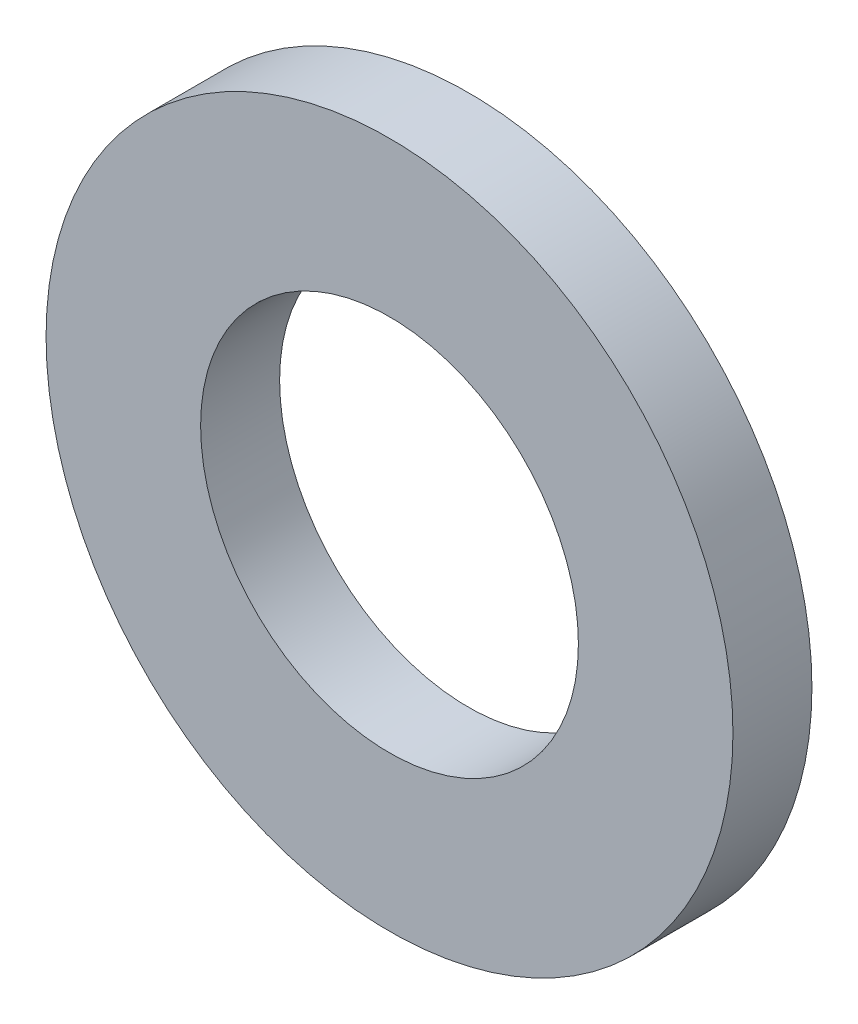
ISO-10303-21;
HEADER;
FILE_DESCRIPTION(('STEP AP214'),'2;1');
FILE_NAME('part.step','',(''),(''),'','','');
FILE_SCHEMA(('AUTOMOTIVE_DESIGN { 1 0 10303 214 1 1 1 1 }'));
ENDSEC;
DATA;
#1=APPLICATION_CONTEXT('core data for automotive mechanical design processes');
#2=APPLICATION_PROTOCOL_DEFINITION('international standard','automotive_design',2000,#1);
#3=PRODUCT_CONTEXT('',#1,'mechanical');
#4=PRODUCT('Part','Part','',(#3));
#5=PRODUCT_RELATED_PRODUCT_CATEGORY('part','',(#4));
#6=PRODUCT_DEFINITION_FORMATION('','',#4);
#7=PRODUCT_DEFINITION_CONTEXT('part definition',#1,'design');
#8=PRODUCT_DEFINITION('design','',#6,#7);
#9=PRODUCT_DEFINITION_SHAPE('','',#8);
#10=(LENGTH_UNIT() NAMED_UNIT(*) SI_UNIT(.MILLI.,.METRE.));
#11=(NAMED_UNIT(*) PLANE_ANGLE_UNIT() SI_UNIT($,.RADIAN.));
#12=(NAMED_UNIT(*) SI_UNIT($,.STERADIAN.) SOLID_ANGLE_UNIT());
#13=UNCERTAINTY_MEASURE_WITH_UNIT(LENGTH_MEASURE(1.E-05),#10,'distance_accuracy_value','');
#14=(GEOMETRIC_REPRESENTATION_CONTEXT(3) GLOBAL_UNCERTAINTY_ASSIGNED_CONTEXT((#13)) GLOBAL_UNIT_ASSIGNED_CONTEXT((#10,
#11,#12)) REPRESENTATION_CONTEXT('',''));
#15=CARTESIAN_POINT('',(0.,0.,0.));
#16=DIRECTION('',(0.,0.,1.));
#17=DIRECTION('',(1.,0.,0.));
#18=AXIS2_PLACEMENT_3D('',#15,#16,#17);
#19=CARTESIAN_POINT('',(0.,0.,2.3));
#20=DIRECTION('',(0.,0.,1.));
#21=DIRECTION('',(1.,0.,0.));
#22=AXIS2_PLACEMENT_3D('',#19,#20,#21);
#23=PLANE('',#22);
#24=CARTESIAN_POINT('',(0.,0.,2.3));
#25=DIRECTION('',(0.,0.,1.));
#26=DIRECTION('',(1.,0.,0.));
#27=AXIS2_PLACEMENT_3D('',#24,#25,#26);
#28=CIRCLE('',#27,10.);
#29=CARTESIAN_POINT('',(10.,0.,2.3));
#30=VERTEX_POINT('',#29);
#31=EDGE_CURVE('E10',#30,#30,#28,.T.);
#32=ORIENTED_EDGE('',*,*,#31,.T.);
#33=EDGE_LOOP('',(#32));
#34=FACE_BOUND('',#33,.T.);
#35=CARTESIAN_POINT('',(0.,0.,2.3));
#36=DIRECTION('',(0.,0.,1.));
#37=DIRECTION('',(1.,0.,0.));
#38=AXIS2_PLACEMENT_3D('',#35,#36,#37);
#39=CIRCLE('',#38,5.5);
#40=CARTESIAN_POINT('',(5.5,0.,2.3));
#41=VERTEX_POINT('',#40);
#42=EDGE_CURVE('E46',#41,#41,#39,.T.);
#43=ORIENTED_EDGE('',*,*,#42,.F.);
#44=EDGE_LOOP('',(#43));
#45=FACE_BOUND('',#44,.T.);
#46=ADVANCED_FACE('F35',(#34,#45),#23,.T.);
#47=CARTESIAN_POINT('',(0.,0.,0.));
#48=DIRECTION('',(0.,0.,1.));
#49=DIRECTION('',(1.,0.,0.));
#50=AXIS2_PLACEMENT_3D('',#47,#48,#49);
#51=PLANE('',#50);
#52=CARTESIAN_POINT('',(0.,0.,0.));
#53=DIRECTION('',(0.,0.,1.));
#54=DIRECTION('',(1.,0.,0.));
#55=AXIS2_PLACEMENT_3D('',#52,#53,#54);
#56=CIRCLE('',#55,10.);
#57=CARTESIAN_POINT('',(10.,0.,0.));
#58=VERTEX_POINT('',#57);
#59=EDGE_CURVE('E39',#58,#58,#56,.T.);
#60=ORIENTED_EDGE('',*,*,#59,.F.);
#61=EDGE_LOOP('',(#60));
#62=FACE_BOUND('',#61,.T.);
#63=CARTESIAN_POINT('',(0.,0.,0.));
#64=DIRECTION('',(0.,0.,1.));
#65=DIRECTION('',(1.,0.,0.));
#66=AXIS2_PLACEMENT_3D('',#63,#64,#65);
#67=CIRCLE('',#66,5.5);
#68=CARTESIAN_POINT('',(5.5,0.,0.));
#69=VERTEX_POINT('',#68);
#70=EDGE_CURVE('E48',#69,#69,#67,.T.);
#71=ORIENTED_EDGE('',*,*,#70,.T.);
#72=EDGE_LOOP('',(#71));
#73=FACE_BOUND('',#72,.T.);
#74=ADVANCED_FACE('F58',(#62,#73),#51,.F.);
#75=CARTESIAN_POINT('',(0.,0.,2.3));
#76=DIRECTION('',(0.,0.,-1.));
#77=DIRECTION('',(-1.,0.,0.));
#78=AXIS2_PLACEMENT_3D('',#75,#76,#77);
#79=CYLINDRICAL_SURFACE('',#78,10.);
#80=ORIENTED_EDGE('',*,*,#31,.F.);
#81=EDGE_LOOP('',(#80));
#82=FACE_BOUND('',#81,.T.);
#83=ORIENTED_EDGE('',*,*,#59,.T.);
#84=EDGE_LOOP('',(#83));
#85=FACE_BOUND('',#84,.T.);
#86=ADVANCED_FACE('F37',(#82,#85),#79,.T.);
#87=CARTESIAN_POINT('',(0.,0.,2.3));
#88=DIRECTION('',(0.,0.,-1.));
#89=DIRECTION('',(-1.,0.,0.));
#90=AXIS2_PLACEMENT_3D('',#87,#88,#89);
#91=CYLINDRICAL_SURFACE('',#90,5.5);
#92=ORIENTED_EDGE('',*,*,#42,.T.);
#93=EDGE_LOOP('',(#92));
#94=FACE_BOUND('',#93,.T.);
#95=ORIENTED_EDGE('',*,*,#70,.F.);
#96=EDGE_LOOP('',(#95));
#97=FACE_BOUND('',#96,.T.);
#98=ADVANCED_FACE('F54',(#94,#97),#91,.F.);
#99=CLOSED_SHELL('',(#46,#74,#86,#98));
#100=MANIFOLD_SOLID_BREP('B2',#99);
#101=ADVANCED_BREP_SHAPE_REPRESENTATION('',(#18,#100),#14);
#102=SHAPE_DEFINITION_REPRESENTATION(#9,#101);
ENDSEC;
END-ISO-10303-21;
